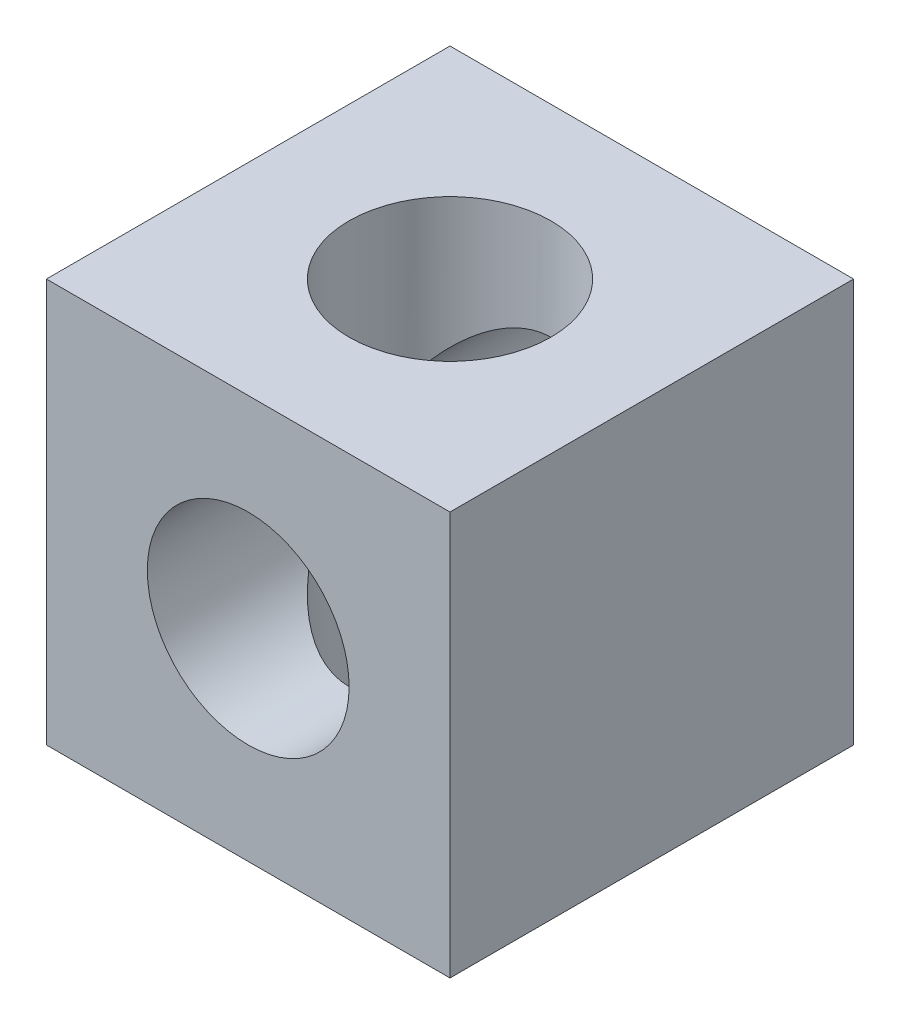
ISO-10303-21;
HEADER;
FILE_DESCRIPTION(('STEP AP214'),'2;1');
FILE_NAME('part.step','',(''),(''),'','','');
FILE_SCHEMA(('AUTOMOTIVE_DESIGN { 1 0 10303 214 1 1 1 1 }'));
ENDSEC;
DATA;
#1=APPLICATION_CONTEXT('core data for automotive mechanical design processes');
#2=APPLICATION_PROTOCOL_DEFINITION('international standard','automotive_design',2000,#1);
#3=PRODUCT_CONTEXT('',#1,'mechanical');
#4=PRODUCT('Part','Part','',(#3));
#5=PRODUCT_RELATED_PRODUCT_CATEGORY('part','',(#4));
#6=PRODUCT_DEFINITION_FORMATION('','',#4);
#7=PRODUCT_DEFINITION_CONTEXT('part definition',#1,'design');
#8=PRODUCT_DEFINITION('design','',#6,#7);
#9=PRODUCT_DEFINITION_SHAPE('','',#8);
#10=(LENGTH_UNIT() NAMED_UNIT(*) SI_UNIT(.MILLI.,.METRE.));
#11=(NAMED_UNIT(*) PLANE_ANGLE_UNIT() SI_UNIT($,.RADIAN.));
#12=(NAMED_UNIT(*) SI_UNIT($,.STERADIAN.) SOLID_ANGLE_UNIT());
#13=UNCERTAINTY_MEASURE_WITH_UNIT(LENGTH_MEASURE(1.E-05),#10,'distance_accuracy_value','');
#14=(GEOMETRIC_REPRESENTATION_CONTEXT(3) GLOBAL_UNCERTAINTY_ASSIGNED_CONTEXT((#13)) GLOBAL_UNIT_ASSIGNED_CONTEXT((#10,
#11,#12)) REPRESENTATION_CONTEXT('',''));
#15=CARTESIAN_POINT('',(0.,0.,0.));
#16=DIRECTION('',(0.,0.,1.));
#17=DIRECTION('',(1.,0.,0.));
#18=AXIS2_PLACEMENT_3D('',#15,#16,#17);
#19=CARTESIAN_POINT('',(-1.16573417585641E-12,1.66533453693773E-13,10.0000000000002));
#20=DIRECTION('',(0.,0.,-1.00000000000002));
#21=DIRECTION('',(-1.00000000000002,0.,0.));
#22=AXIS2_PLACEMENT_3D('',#19,#20,#21);
#23=CYLINDRICAL_SURFACE('',#22,2.5);
#24=CARTESIAN_POINT('',(2.4980018054066E-12,3.88578058618805E-13,5.00000000000006));
#25=DIRECTION('',(0.,0.707106781186547,-0.707106781186568));
#26=DIRECTION('',(0.,-0.707106781186548,-0.707106781186569));
#27=AXIS2_PLACEMENT_3D('',#24,#25,#26);
#28=ELLIPSE('',#27,3.53553390593274,2.5);
#29=CARTESIAN_POINT('',(2.50000000000011,4.16333634234434E-13,5.00000000000023));
#30=VERTEX_POINT('',#29);
#31=CARTESIAN_POINT('',(-2.50000000000167,4.85722573273506E-13,5.00000000000016));
#32=VERTEX_POINT('',#31);
#33=EDGE_CURVE('E11',#30,#32,#28,.F.);
#34=ORIENTED_EDGE('',*,*,#33,.F.);
#35=CARTESIAN_POINT('',(2.4980018054066E-12,3.88578058618805E-13,5.00000000000006));
#36=DIRECTION('',(0.,-0.707106781186548,-0.707106781186569));
#37=DIRECTION('',(0.,0.707106781186547,-0.707106781186568));
#38=AXIS2_PLACEMENT_3D('',#35,#36,#37);
#39=ELLIPSE('',#38,3.53553390593274,2.5);
#40=EDGE_CURVE('E30',#32,#30,#39,.F.);
#41=ORIENTED_EDGE('',*,*,#40,.F.);
#42=EDGE_LOOP('',(#34,#41));
#43=FACE_BOUND('',#42,.T.);
#44=CARTESIAN_POINT('',(-1.16573417585641E-12,1.66533453693773E-13,10.0000000000002));
#45=DIRECTION('',(0.,0.,1.00000000000002));
#46=DIRECTION('',(1.00000000000002,0.,0.));
#47=AXIS2_PLACEMENT_3D('',#44,#45,#46);
#48=CIRCLE('',#47,2.5);
#49=CARTESIAN_POINT('',(2.49999999999887,1.91999194321113E-13,10.0000000000002));
#50=VERTEX_POINT('',#49);
#51=EDGE_CURVE('E106',#50,#50,#48,.T.);
#52=ORIENTED_EDGE('',*,*,#51,.T.);
#53=EDGE_LOOP('',(#52));
#54=FACE_BOUND('',#53,.T.);
#55=ADVANCED_FACE('F16',(#43,#54),#23,.F.);
#56=CARTESIAN_POINT('',(-5.00000000000322,-4.99999999999955,10.0000000000004));
#57=DIRECTION('',(0.,0.,-1.00000000000002));
#58=DIRECTION('',(-1.00000000000002,0.,0.));
#59=AXIS2_PLACEMENT_3D('',#56,#57,#58);
#60=PLANE('',#59);
#61=DIRECTION('',(0.,-0.999999999999998,0.));
#62=VECTOR('',#61,1.);
#63=CARTESIAN_POINT('',(-5.00000000000322,-4.99999999999955,10.0000000000004));
#64=LINE('',#63,#62);
#65=CARTESIAN_POINT('',(-5.00000000000012,5.00000000000007,10.0000000000001));
#66=VERTEX_POINT('',#65);
#67=CARTESIAN_POINT('',(-5.00000000000322,-4.99999999999955,10.0000000000004));
#68=VERTEX_POINT('',#67);
#69=EDGE_CURVE('E95',#66,#68,#64,.T.);
#70=ORIENTED_EDGE('',*,*,#69,.T.);
#71=DIRECTION('',(1.00000000000002,0.,0.));
#72=VECTOR('',#71,1.);
#73=CARTESIAN_POINT('',(-5.00000000000322,-4.99999999999955,10.0000000000004));
#74=LINE('',#73,#72);
#75=CARTESIAN_POINT('',(5.00000000000245,-4.99999999999969,10.0000000000003));
#76=VERTEX_POINT('',#75);
#77=EDGE_CURVE('E93',#68,#76,#74,.T.);
#78=ORIENTED_EDGE('',*,*,#77,.T.);
#79=DIRECTION('',(0.,0.999999999999998,0.));
#80=VECTOR('',#79,1.);
#81=CARTESIAN_POINT('',(5.00000000000245,-4.99999999999969,10.0000000000003));
#82=LINE('',#81,#80);
#83=CARTESIAN_POINT('',(4.99999999999928,5.00000000000003,10.));
#84=VERTEX_POINT('',#83);
#85=EDGE_CURVE('E91',#76,#84,#82,.T.);
#86=ORIENTED_EDGE('',*,*,#85,.T.);
#87=DIRECTION('',(-1.00000000000002,0.,0.));
#88=VECTOR('',#87,1.);
#89=CARTESIAN_POINT('',(-5.00000000000012,5.00000000000007,10.0000000000001));
#90=LINE('',#89,#88);
#91=EDGE_CURVE('E38',#84,#66,#90,.T.);
#92=ORIENTED_EDGE('',*,*,#91,.T.);
#93=EDGE_LOOP('',(#70,#78,#86,#92));
#94=FACE_BOUND('',#93,.T.);
#95=ORIENTED_EDGE('',*,*,#51,.F.);
#96=EDGE_LOOP('',(#95));
#97=FACE_BOUND('',#96,.T.);
#98=ADVANCED_FACE('F138',(#94,#97),#60,.F.);
#99=CARTESIAN_POINT('',(-5.00000000000034,-5.,0.));
#100=DIRECTION('',(0.,0.,-1.00000000000002));
#101=DIRECTION('',(-1.00000000000002,0.,0.));
#102=AXIS2_PLACEMENT_3D('',#99,#100,#101);
#103=PLANE('',#102);
#104=DIRECTION('',(0.,-0.999999999999998,0.));
#105=VECTOR('',#104,1.);
#106=CARTESIAN_POINT('',(-5.00000000000034,-5.,0.));
#107=LINE('',#106,#105);
#108=CARTESIAN_POINT('',(-4.99999999999723,5.00000000000006,-1.71737624121704E-13));
#109=VERTEX_POINT('',#108);
#110=CARTESIAN_POINT('',(-5.00000000000034,-5.,0.));
#111=VERTEX_POINT('',#110);
#112=EDGE_CURVE('E103',#109,#111,#107,.T.);
#113=ORIENTED_EDGE('',*,*,#112,.F.);
#114=DIRECTION('',(-1.00000000000002,0.,0.));
#115=VECTOR('',#114,1.);
#116=CARTESIAN_POINT('',(-4.99999999999723,5.00000000000006,-1.71737624121704E-13));
#117=LINE('',#116,#115);
#118=CARTESIAN_POINT('',(5.00000000000289,5.0000000000008,-1.11022302462516E-13));
#119=VERTEX_POINT('',#118);
#120=EDGE_CURVE('E97',#119,#109,#117,.T.);
#121=ORIENTED_EDGE('',*,*,#120,.F.);
#122=DIRECTION('',(0.,0.999999999999998,0.));
#123=VECTOR('',#122,1.);
#124=CARTESIAN_POINT('',(4.99999999999978,-4.99999999999996,0.));
#125=LINE('',#124,#123);
#126=CARTESIAN_POINT('',(4.99999999999978,-4.99999999999996,0.));
#127=VERTEX_POINT('',#126);
#128=EDGE_CURVE('E99',#127,#119,#125,.T.);
#129=ORIENTED_EDGE('',*,*,#128,.F.);
#130=DIRECTION('',(1.00000000000002,0.,0.));
#131=VECTOR('',#130,1.);
#132=CARTESIAN_POINT('',(-5.00000000000034,-5.,0.));
#133=LINE('',#132,#131);
#134=EDGE_CURVE('E101',#111,#127,#133,.T.);
#135=ORIENTED_EDGE('',*,*,#134,.F.);
#136=EDGE_LOOP('',(#113,#121,#129,#135));
#137=FACE_BOUND('',#136,.T.);
#138=CARTESIAN_POINT('',(0.,0.,0.));
#139=DIRECTION('',(0.,0.,1.00000000000002));
#140=DIRECTION('',(1.00000000000002,0.,0.));
#141=AXIS2_PLACEMENT_3D('',#138,#139,#140);
#142=CIRCLE('',#141,2.5);
#143=CARTESIAN_POINT('',(2.50000000000004,0.,0.));
#144=VERTEX_POINT('',#143);
#145=EDGE_CURVE('E109',#144,#144,#142,.T.);
#146=ORIENTED_EDGE('',*,*,#145,.T.);
#147=EDGE_LOOP('',(#146));
#148=FACE_BOUND('',#147,.T.);
#149=ADVANCED_FACE('F132',(#137,#148),#103,.T.);
#150=CARTESIAN_POINT('',(-5.00000000000322,-4.99999999999955,10.0000000000004));
#151=DIRECTION('',(1.00000000000002,0.,0.));
#152=DIRECTION('',(0.,0.,-1.00000000000002));
#153=AXIS2_PLACEMENT_3D('',#150,#151,#152);
#154=PLANE('',#153);
#155=ORIENTED_EDGE('',*,*,#112,.T.);
#156=DIRECTION('',(0.,0.,-1.00000000000002));
#157=VECTOR('',#156,1.);
#158=CARTESIAN_POINT('',(-5.00000000000322,-4.99999999999955,10.0000000000004));
#159=LINE('',#158,#157);
#160=EDGE_CURVE('E73',#68,#111,#159,.T.);
#161=ORIENTED_EDGE('',*,*,#160,.F.);
#162=ORIENTED_EDGE('',*,*,#69,.F.);
#163=DIRECTION('',(0.,0.,-1.00000000000002));
#164=VECTOR('',#163,1.);
#165=CARTESIAN_POINT('',(-5.00000000000012,5.00000000000007,10.0000000000001));
#166=LINE('',#165,#164);
#167=EDGE_CURVE('E87',#66,#109,#166,.T.);
#168=ORIENTED_EDGE('',*,*,#167,.T.);
#169=EDGE_LOOP('',(#155,#161,#162,#168));
#170=FACE_BOUND('',#169,.T.);
#171=ADVANCED_FACE('F18',(#170),#154,.F.);
#172=CARTESIAN_POINT('',(-5.00000000000322,-4.99999999999955,10.0000000000004));
#173=DIRECTION('',(0.,0.999999999999998,0.));
#174=DIRECTION('',(0.,0.,1.00000000000002));
#175=AXIS2_PLACEMENT_3D('',#172,#173,#174);
#176=PLANE('',#175);
#177=CARTESIAN_POINT('',(1.72084568816899E-12,-4.99999999999966,5.00000000000004));
#178=DIRECTION('',(0.,0.999999999999998,0.));
#179=DIRECTION('',(0.,0.,1.00000000000002));
#180=AXIS2_PLACEMENT_3D('',#177,#178,#179);
#181=CIRCLE('',#180,2.5);
#182=CARTESIAN_POINT('',(1.71093065930161E-12,-4.99999999999966,7.50000000000009));
#183=VERTEX_POINT('',#182);
#184=EDGE_CURVE('E112',#183,#183,#181,.T.);
#185=ORIENTED_EDGE('',*,*,#184,.T.);
#186=EDGE_LOOP('',(#185));
#187=FACE_BOUND('',#186,.T.);
#188=ORIENTED_EDGE('',*,*,#134,.T.);
#189=DIRECTION('',(0.,0.,-1.00000000000002));
#190=VECTOR('',#189,1.);
#191=CARTESIAN_POINT('',(5.00000000000245,-4.99999999999969,10.0000000000003));
#192=LINE('',#191,#190);
#193=EDGE_CURVE('E81',#76,#127,#192,.T.);
#194=ORIENTED_EDGE('',*,*,#193,.F.);
#195=ORIENTED_EDGE('',*,*,#77,.F.);
#196=ORIENTED_EDGE('',*,*,#160,.T.);
#197=EDGE_LOOP('',(#188,#194,#195,#196));
#198=FACE_BOUND('',#197,.T.);
#199=ADVANCED_FACE('F136',(#187,#198),#176,.F.);
#200=CARTESIAN_POINT('',(5.00000000000245,-4.99999999999969,10.0000000000003));
#201=DIRECTION('',(-1.00000000000002,0.,0.));
#202=DIRECTION('',(0.,0.,1.00000000000002));
#203=AXIS2_PLACEMENT_3D('',#200,#201,#202);
#204=PLANE('',#203);
#205=ORIENTED_EDGE('',*,*,#128,.T.);
#206=DIRECTION('',(0.,0.,-1.00000000000002));
#207=VECTOR('',#206,1.);
#208=CARTESIAN_POINT('',(4.99999999999928,5.00000000000003,10.));
#209=LINE('',#208,#207);
#210=EDGE_CURVE('E84',#84,#119,#209,.T.);
#211=ORIENTED_EDGE('',*,*,#210,.F.);
#212=ORIENTED_EDGE('',*,*,#85,.F.);
#213=ORIENTED_EDGE('',*,*,#193,.T.);
#214=EDGE_LOOP('',(#205,#211,#212,#213));
#215=FACE_BOUND('',#214,.T.);
#216=ADVANCED_FACE('F122',(#215),#204,.F.);
#217=CARTESIAN_POINT('',(-5.00000000000012,5.00000000000007,10.0000000000001));
#218=DIRECTION('',(0.,-0.999999999999998,0.));
#219=DIRECTION('',(1.00000000000002,0.,0.));
#220=AXIS2_PLACEMENT_3D('',#217,#218,#219);
#221=PLANE('',#220);
#222=CARTESIAN_POINT('',(-7.7715611723761E-13,5.00000000000017,5.00000000000017));
#223=DIRECTION('',(0.,0.999999999999998,0.));
#224=DIRECTION('',(0.,0.,1.00000000000002));
#225=AXIS2_PLACEMENT_3D('',#222,#223,#224);
#226=CIRCLE('',#225,2.5);
#227=CARTESIAN_POINT('',(-7.8707114610499E-13,5.00000000000017,7.50000000000021));
#228=VERTEX_POINT('',#227);
#229=EDGE_CURVE('E115',#228,#228,#226,.T.);
#230=ORIENTED_EDGE('',*,*,#229,.F.);
#231=EDGE_LOOP('',(#230));
#232=FACE_BOUND('',#231,.T.);
#233=ORIENTED_EDGE('',*,*,#120,.T.);
#234=ORIENTED_EDGE('',*,*,#167,.F.);
#235=ORIENTED_EDGE('',*,*,#91,.F.);
#236=ORIENTED_EDGE('',*,*,#210,.T.);
#237=EDGE_LOOP('',(#233,#234,#235,#236));
#238=FACE_BOUND('',#237,.T.);
#239=ADVANCED_FACE('F119',(#232,#238),#221,.F.);
#240=CARTESIAN_POINT('',(2.4980018054066E-12,3.88578058618805E-13,5.00000000000006));
#241=DIRECTION('',(0.,0.707106781186547,-0.707106781186568));
#242=DIRECTION('',(0.,-0.707106781186548,-0.707106781186569));
#243=AXIS2_PLACEMENT_3D('',#240,#241,#242);
#244=ELLIPSE('',#243,3.53553390593274,2.5);
#245=EDGE_CURVE('E24',#30,#32,#244,.T.);
#246=ORIENTED_EDGE('',*,*,#245,.F.);
#247=CARTESIAN_POINT('',(2.4980018054066E-12,3.88578058618805E-13,5.00000000000006));
#248=DIRECTION('',(0.,-0.707106781186548,-0.707106781186569));
#249=DIRECTION('',(0.,0.707106781186547,-0.707106781186568));
#250=AXIS2_PLACEMENT_3D('',#247,#248,#249);
#251=ELLIPSE('',#250,3.53553390593274,2.5);
#252=EDGE_CURVE('E64',#32,#30,#251,.T.);
#253=ORIENTED_EDGE('',*,*,#252,.F.);
#254=EDGE_LOOP('',(#246,#253));
#255=FACE_BOUND('',#254,.T.);
#256=ORIENTED_EDGE('',*,*,#145,.F.);
#257=EDGE_LOOP('',(#256));
#258=FACE_BOUND('',#257,.T.);
#259=ADVANCED_FACE('F76',(#255,#258),#23,.F.);
#260=CARTESIAN_POINT('',(1.72084568816899E-12,-4.99999999999966,5.00000000000004));
#261=DIRECTION('',(0.,0.999999999999998,0.));
#262=DIRECTION('',(0.,0.,1.00000000000002));
#263=AXIS2_PLACEMENT_3D('',#260,#261,#262);
#264=CYLINDRICAL_SURFACE('',#263,2.5);
#265=ORIENTED_EDGE('',*,*,#245,.T.);
#266=ORIENTED_EDGE('',*,*,#40,.T.);
#267=EDGE_LOOP('',(#265,#266));
#268=FACE_BOUND('',#267,.T.);
#269=ORIENTED_EDGE('',*,*,#184,.F.);
#270=EDGE_LOOP('',(#269));
#271=FACE_BOUND('',#270,.T.);
#272=ADVANCED_FACE('F71',(#268,#271),#264,.F.);
#273=ORIENTED_EDGE('',*,*,#33,.T.);
#274=ORIENTED_EDGE('',*,*,#252,.T.);
#275=EDGE_LOOP('',(#273,#274));
#276=FACE_BOUND('',#275,.T.);
#277=ORIENTED_EDGE('',*,*,#229,.T.);
#278=EDGE_LOOP('',(#277));
#279=FACE_BOUND('',#278,.T.);
#280=ADVANCED_FACE('F65',(#276,#279),#264,.F.);
#281=CLOSED_SHELL('',(#55,#98,#149,#171,#199,#216,#239,#259,#272,#280));
#282=MANIFOLD_SOLID_BREP('B1',#281);
#283=ADVANCED_BREP_SHAPE_REPRESENTATION('',(#18,#282),#14);
#284=SHAPE_DEFINITION_REPRESENTATION(#9,#283);
ENDSEC;
END-ISO-10303-21;
